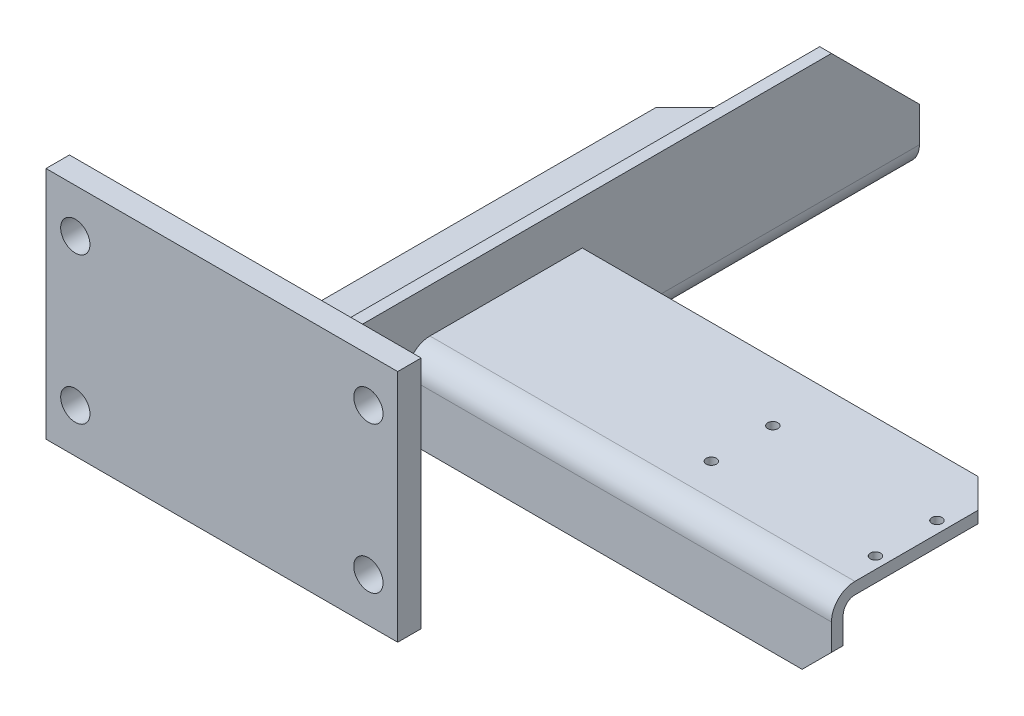
ISO-10303-21;
HEADER;
FILE_DESCRIPTION(('STEP AP214'),'2;1');
FILE_NAME('part.step','',(''),(''),'','','');
FILE_SCHEMA(('AUTOMOTIVE_DESIGN { 1 0 10303 214 1 1 1 1 }'));
ENDSEC;
DATA;
#1=APPLICATION_CONTEXT('core data for automotive mechanical design processes');
#2=APPLICATION_PROTOCOL_DEFINITION('international standard','automotive_design',2000,#1);
#3=PRODUCT_CONTEXT('',#1,'mechanical');
#4=PRODUCT('Part','Part','',(#3));
#5=PRODUCT_RELATED_PRODUCT_CATEGORY('part','',(#4));
#6=PRODUCT_DEFINITION_FORMATION('','',#4);
#7=PRODUCT_DEFINITION_CONTEXT('part definition',#1,'design');
#8=PRODUCT_DEFINITION('design','',#6,#7);
#9=PRODUCT_DEFINITION_SHAPE('','',#8);
#10=(LENGTH_UNIT() NAMED_UNIT(*) SI_UNIT(.MILLI.,.METRE.));
#11=(NAMED_UNIT(*) PLANE_ANGLE_UNIT() SI_UNIT($,.RADIAN.));
#12=(NAMED_UNIT(*) SI_UNIT($,.STERADIAN.) SOLID_ANGLE_UNIT());
#13=UNCERTAINTY_MEASURE_WITH_UNIT(LENGTH_MEASURE(1.E-05),#10,'distance_accuracy_value','');
#14=(GEOMETRIC_REPRESENTATION_CONTEXT(3) GLOBAL_UNCERTAINTY_ASSIGNED_CONTEXT((#13)) GLOBAL_UNIT_ASSIGNED_CONTEXT((#10,
#11,#12)) REPRESENTATION_CONTEXT('',''));
#15=CARTESIAN_POINT('',(0.,0.,0.));
#16=DIRECTION('',(0.,0.,1.));
#17=DIRECTION('',(1.,0.,0.));
#18=AXIS2_PLACEMENT_3D('',#15,#16,#17);
#19=CARTESIAN_POINT('',(90.,70.,-200.));
#20=DIRECTION('',(-1.,0.,0.));
#21=DIRECTION('',(0.,0.,1.));
#22=AXIS2_PLACEMENT_3D('',#19,#20,#21);
#23=PLANE('',#22);
#24=DIRECTION('',(0.,-1.,0.));
#25=VECTOR('',#24,1.);
#26=CARTESIAN_POINT('',(90.,47.,-25.));
#27=LINE('',#26,#25);
#28=CARTESIAN_POINT('',(90.,47.,-25.));
#29=VERTEX_POINT('',#28);
#30=CARTESIAN_POINT('',(90.,28.,-25.));
#31=VERTEX_POINT('',#30);
#32=EDGE_CURVE('E429',#29,#31,#27,.T.);
#33=ORIENTED_EDGE('',*,*,#32,.F.);
#34=CARTESIAN_POINT('',(90.,47.,-33.));
#35=DIRECTION('',(1.,0.,0.));
#36=DIRECTION('',(0.,0.,-1.));
#37=AXIS2_PLACEMENT_3D('',#34,#35,#36);
#38=CIRCLE('',#37,8.);
#39=CARTESIAN_POINT('',(90.,55.,-33.));
#40=VERTEX_POINT('',#39);
#41=EDGE_CURVE('E427',#40,#29,#38,.T.);
#42=ORIENTED_EDGE('',*,*,#41,.F.);
#43=DIRECTION('',(0.,0.,1.));
#44=VECTOR('',#43,1.);
#45=CARTESIAN_POINT('',(90.,55.,-85.));
#46=LINE('',#45,#44);
#47=CARTESIAN_POINT('',(90.,55.,-85.));
#48=VERTEX_POINT('',#47);
#49=EDGE_CURVE('E418',#48,#40,#46,.T.);
#50=ORIENTED_EDGE('',*,*,#49,.F.);
#51=DIRECTION('',(0.,1.,0.));
#52=VECTOR('',#51,1.);
#53=CARTESIAN_POINT('',(90.,51.,-85.));
#54=LINE('',#53,#52);
#55=CARTESIAN_POINT('',(90.,51.,-85.));
#56=VERTEX_POINT('',#55);
#57=EDGE_CURVE('E420',#56,#48,#54,.T.);
#58=ORIENTED_EDGE('',*,*,#57,.F.);
#59=DIRECTION('',(0.,0.,-1.));
#60=VECTOR('',#59,1.);
#61=CARTESIAN_POINT('',(90.,51.,-33.));
#62=LINE('',#61,#60);
#63=CARTESIAN_POINT('',(90.,51.,-33.));
#64=VERTEX_POINT('',#63);
#65=EDGE_CURVE('E423',#64,#56,#62,.T.);
#66=ORIENTED_EDGE('',*,*,#65,.F.);
#67=CARTESIAN_POINT('',(90.,47.,-33.));
#68=DIRECTION('',(-1.,0.,0.));
#69=DIRECTION('',(0.,0.,-1.));
#70=AXIS2_PLACEMENT_3D('',#67,#68,#69);
#71=CIRCLE('',#70,4.);
#72=CARTESIAN_POINT('',(90.,47.,-29.));
#73=VERTEX_POINT('',#72);
#74=EDGE_CURVE('E219',#73,#64,#71,.T.);
#75=ORIENTED_EDGE('',*,*,#74,.F.);
#76=DIRECTION('',(0.,1.,0.));
#77=VECTOR('',#76,1.);
#78=CARTESIAN_POINT('',(90.,28.,-29.));
#79=LINE('',#78,#77);
#80=CARTESIAN_POINT('',(90.,28.,-29.));
#81=VERTEX_POINT('',#80);
#82=EDGE_CURVE('E215',#81,#73,#79,.T.);
#83=ORIENTED_EDGE('',*,*,#82,.F.);
#84=DIRECTION('',(0.,0.,1.));
#85=VECTOR('',#84,1.);
#86=CARTESIAN_POINT('',(90.,28.,-200.));
#87=LINE('',#86,#85);
#88=CARTESIAN_POINT('',(90.,28.,-200.));
#89=VERTEX_POINT('',#88);
#90=EDGE_CURVE('E280',#89,#81,#87,.T.);
#91=ORIENTED_EDGE('',*,*,#90,.F.);
#92=DIRECTION('',(0.,-1.,0.));
#93=VECTOR('',#92,1.);
#94=CARTESIAN_POINT('',(90.,70.,-200.));
#95=LINE('',#94,#93);
#96=CARTESIAN_POINT('',(90.,40.,-200.));
#97=VERTEX_POINT('',#96);
#98=EDGE_CURVE('E248',#97,#89,#95,.T.);
#99=ORIENTED_EDGE('',*,*,#98,.F.);
#100=DIRECTION('',(0.,0.707106781186546,0.707106781186549));
#101=VECTOR('',#100,1.);
#102=CARTESIAN_POINT('',(90.,40.,-200.));
#103=LINE('',#102,#101);
#104=CARTESIAN_POINT('',(90.,70.,-170.));
#105=VERTEX_POINT('',#104);
#106=EDGE_CURVE('E355',#97,#105,#103,.T.);
#107=ORIENTED_EDGE('',*,*,#106,.T.);
#108=DIRECTION('',(0.,0.,1.));
#109=VECTOR('',#108,1.);
#110=CARTESIAN_POINT('',(90.,70.,-200.));
#111=LINE('',#110,#109);
#112=CARTESIAN_POINT('',(90.,70.,0.));
#113=VERTEX_POINT('',#112);
#114=EDGE_CURVE('E283',#105,#113,#111,.T.);
#115=ORIENTED_EDGE('',*,*,#114,.T.);
#116=DIRECTION('',(0.,-1.,0.));
#117=VECTOR('',#116,1.);
#118=CARTESIAN_POINT('',(90.,70.,0.));
#119=LINE('',#118,#117);
#120=CARTESIAN_POINT('',(90.,28.,0.));
#121=VERTEX_POINT('',#120);
#122=EDGE_CURVE('E268',#113,#121,#119,.T.);
#123=ORIENTED_EDGE('',*,*,#122,.T.);
#124=EDGE_CURVE('E279',#31,#121,#87,.T.);
#125=ORIENTED_EDGE('',*,*,#124,.F.);
#126=EDGE_LOOP('',(#33,#42,#50,#58,#66,#75,#83,#91,#99,#107,#115,#123,#125));
#127=FACE_BOUND('',#126,.T.);
#128=ADVANCED_FACE('F34',(#127),#23,.F.);
#129=CARTESIAN_POINT('',(0.,0.,0.));
#130=DIRECTION('',(0.,0.,-1.));
#131=DIRECTION('',(-1.,0.,0.));
#132=AXIS2_PLACEMENT_3D('',#129,#130,#131);
#133=PLANE('',#132);
#134=CARTESIAN_POINT('',(110.,65.,0.));
#135=DIRECTION('',(0.,0.,-1.));
#136=DIRECTION('',(-1.,0.,0.));
#137=AXIS2_PLACEMENT_3D('',#134,#135,#136);
#138=CIRCLE('',#137,5.00000000000001);
#139=CARTESIAN_POINT('',(105.,65.,0.));
#140=VERTEX_POINT('',#139);
#141=EDGE_CURVE('E295',#140,#140,#138,.F.);
#142=ORIENTED_EDGE('',*,*,#141,.T.);
#143=EDGE_LOOP('',(#142));
#144=FACE_BOUND('',#143,.T.);
#145=CARTESIAN_POINT('',(110.,15.,0.));
#146=DIRECTION('',(0.,0.,-1.));
#147=DIRECTION('',(-1.,0.,0.));
#148=AXIS2_PLACEMENT_3D('',#145,#146,#147);
#149=CIRCLE('',#148,5.);
#150=CARTESIAN_POINT('',(105.,15.,0.));
#151=VERTEX_POINT('',#150);
#152=EDGE_CURVE('E306',#151,#151,#149,.F.);
#153=ORIENTED_EDGE('',*,*,#152,.T.);
#154=EDGE_LOOP('',(#153));
#155=FACE_BOUND('',#154,.T.);
#156=CARTESIAN_POINT('',(10.,15.,0.));
#157=DIRECTION('',(0.,0.,-1.));
#158=DIRECTION('',(-1.,0.,0.));
#159=AXIS2_PLACEMENT_3D('',#156,#157,#158);
#160=CIRCLE('',#159,5.);
#161=CARTESIAN_POINT('',(5.,15.,0.));
#162=VERTEX_POINT('',#161);
#163=EDGE_CURVE('E300',#162,#162,#160,.F.);
#164=ORIENTED_EDGE('',*,*,#163,.T.);
#165=EDGE_LOOP('',(#164));
#166=FACE_BOUND('',#165,.T.);
#167=CARTESIAN_POINT('',(10.,65.,0.));
#168=DIRECTION('',(0.,0.,-1.));
#169=DIRECTION('',(-1.,0.,0.));
#170=AXIS2_PLACEMENT_3D('',#167,#168,#169);
#171=CIRCLE('',#170,5.);
#172=CARTESIAN_POINT('',(5.,65.,0.));
#173=VERTEX_POINT('',#172);
#174=EDGE_CURVE('E299',#173,#173,#171,.F.);
#175=ORIENTED_EDGE('',*,*,#174,.T.);
#176=EDGE_LOOP('',(#175));
#177=FACE_BOUND('',#176,.T.);
#178=DIRECTION('',(0.,-1.,0.));
#179=VECTOR('',#178,1.);
#180=CARTESIAN_POINT('',(0.,0.,0.));
#181=LINE('',#180,#179);
#182=CARTESIAN_POINT('',(0.,80.,0.));
#183=VERTEX_POINT('',#182);
#184=CARTESIAN_POINT('',(0.,0.,0.));
#185=VERTEX_POINT('',#184);
#186=EDGE_CURVE('E317',#183,#185,#181,.T.);
#187=ORIENTED_EDGE('',*,*,#186,.F.);
#188=DIRECTION('',(-1.,0.,0.));
#189=VECTOR('',#188,1.);
#190=CARTESIAN_POINT('',(0.,80.,0.));
#191=LINE('',#190,#189);
#192=CARTESIAN_POINT('',(120.,80.,0.));
#193=VERTEX_POINT('',#192);
#194=EDGE_CURVE('E324',#193,#183,#191,.T.);
#195=ORIENTED_EDGE('',*,*,#194,.F.);
#196=DIRECTION('',(0.,1.,0.));
#197=VECTOR('',#196,1.);
#198=CARTESIAN_POINT('',(120.,0.,0.));
#199=LINE('',#198,#197);
#200=CARTESIAN_POINT('',(120.,0.,0.));
#201=VERTEX_POINT('',#200);
#202=EDGE_CURVE('E335',#201,#193,#199,.T.);
#203=ORIENTED_EDGE('',*,*,#202,.F.);
#204=DIRECTION('',(1.,0.,0.));
#205=VECTOR('',#204,1.);
#206=CARTESIAN_POINT('',(0.,0.,0.));
#207=LINE('',#206,#205);
#208=EDGE_CURVE('E333',#185,#201,#207,.T.);
#209=ORIENTED_EDGE('',*,*,#208,.F.);
#210=EDGE_LOOP('',(#187,#195,#203,#209));
#211=FACE_BOUND('',#210,.T.);
#212=DIRECTION('',(1.,0.,0.));
#213=VECTOR('',#212,1.);
#214=CARTESIAN_POINT('',(82.,23.9667476786463,0.));
#215=LINE('',#214,#213);
#216=CARTESIAN_POINT('',(30.,23.9667476786462,0.));
#217=VERTEX_POINT('',#216);
#218=CARTESIAN_POINT('',(82.,23.9667476786462,0.));
#219=VERTEX_POINT('',#218);
#220=EDGE_CURVE('E258',#217,#219,#215,.T.);
#221=ORIENTED_EDGE('',*,*,#220,.F.);
#222=DIRECTION('',(0.,1.,0.));
#223=VECTOR('',#222,1.);
#224=CARTESIAN_POINT('',(30.,23.9667476786462,0.));
#225=LINE('',#224,#223);
#226=CARTESIAN_POINT('',(30.,20.,0.));
#227=VERTEX_POINT('',#226);
#228=EDGE_CURVE('E236',#227,#217,#225,.T.);
#229=ORIENTED_EDGE('',*,*,#228,.F.);
#230=DIRECTION('',(-1.,0.,0.));
#231=VECTOR('',#230,1.);
#232=CARTESIAN_POINT('',(30.,20.,0.));
#233=LINE('',#232,#231);
#234=CARTESIAN_POINT('',(82.,20.,0.));
#235=VERTEX_POINT('',#234);
#236=EDGE_CURVE('E243',#235,#227,#233,.T.);
#237=ORIENTED_EDGE('',*,*,#236,.F.);
#238=CARTESIAN_POINT('',(82.,28.,0.));
#239=DIRECTION('',(0.,0.,-1.));
#240=DIRECTION('',(-1.,0.,0.));
#241=AXIS2_PLACEMENT_3D('',#238,#239,#240);
#242=CIRCLE('',#241,8.);
#243=EDGE_CURVE('E271',#121,#235,#242,.T.);
#244=ORIENTED_EDGE('',*,*,#243,.F.);
#245=ORIENTED_EDGE('',*,*,#122,.F.);
#246=DIRECTION('',(1.,0.,0.));
#247=VECTOR('',#246,1.);
#248=CARTESIAN_POINT('',(86.,70.,0.));
#249=LINE('',#248,#247);
#250=CARTESIAN_POINT('',(86.,70.,0.));
#251=VERTEX_POINT('',#250);
#252=EDGE_CURVE('E265',#251,#113,#249,.T.);
#253=ORIENTED_EDGE('',*,*,#252,.F.);
#254=DIRECTION('',(0.,1.,0.));
#255=VECTOR('',#254,1.);
#256=CARTESIAN_POINT('',(86.,27.9667476786462,0.));
#257=LINE('',#256,#255);
#258=CARTESIAN_POINT('',(86.,27.9667476786462,0.));
#259=VERTEX_POINT('',#258);
#260=EDGE_CURVE('E262',#259,#251,#257,.T.);
#261=ORIENTED_EDGE('',*,*,#260,.F.);
#262=CARTESIAN_POINT('',(82.,27.9667476786462,0.));
#263=DIRECTION('',(0.,0.,1.));
#264=DIRECTION('',(-1.,0.,0.));
#265=AXIS2_PLACEMENT_3D('',#262,#263,#264);
#266=CIRCLE('',#265,4.00000000000001);
#267=EDGE_CURVE('E260',#219,#259,#266,.T.);
#268=ORIENTED_EDGE('',*,*,#267,.F.);
#269=EDGE_LOOP('',(#221,#229,#237,#244,#245,#253,#261,#268));
#270=FACE_BOUND('',#269,.T.);
#271=ADVANCED_FACE('F494',(#144,#155,#166,#177,#211,#270),#133,.T.);
#272=CARTESIAN_POINT('',(0.,0.,8.));
#273=DIRECTION('',(1.,0.,0.));
#274=DIRECTION('',(0.,0.,-1.));
#275=AXIS2_PLACEMENT_3D('',#272,#273,#274);
#276=PLANE('',#275);
#277=ORIENTED_EDGE('',*,*,#186,.T.);
#278=DIRECTION('',(0.,0.,-1.));
#279=VECTOR('',#278,1.);
#280=CARTESIAN_POINT('',(0.,0.,8.));
#281=LINE('',#280,#279);
#282=CARTESIAN_POINT('',(0.,0.,8.));
#283=VERTEX_POINT('',#282);
#284=EDGE_CURVE('E346',#283,#185,#281,.T.);
#285=ORIENTED_EDGE('',*,*,#284,.F.);
#286=DIRECTION('',(0.,-1.,0.));
#287=VECTOR('',#286,1.);
#288=CARTESIAN_POINT('',(0.,0.,8.));
#289=LINE('',#288,#287);
#290=CARTESIAN_POINT('',(0.,80.,8.));
#291=VERTEX_POINT('',#290);
#292=EDGE_CURVE('E320',#291,#283,#289,.T.);
#293=ORIENTED_EDGE('',*,*,#292,.F.);
#294=DIRECTION('',(0.,0.,-1.));
#295=VECTOR('',#294,1.);
#296=CARTESIAN_POINT('',(0.,80.,8.));
#297=LINE('',#296,#295);
#298=EDGE_CURVE('E330',#291,#183,#297,.T.);
#299=ORIENTED_EDGE('',*,*,#298,.T.);
#300=EDGE_LOOP('',(#277,#285,#293,#299));
#301=FACE_BOUND('',#300,.T.);
#302=ADVANCED_FACE('F499',(#301),#276,.F.);
#303=CARTESIAN_POINT('',(0.,0.,8.));
#304=DIRECTION('',(0.,1.,0.));
#305=DIRECTION('',(0.,0.,1.));
#306=AXIS2_PLACEMENT_3D('',#303,#304,#305);
#307=PLANE('',#306);
#308=ORIENTED_EDGE('',*,*,#208,.T.);
#309=DIRECTION('',(0.,0.,-1.));
#310=VECTOR('',#309,1.);
#311=CARTESIAN_POINT('',(120.,0.,8.));
#312=LINE('',#311,#310);
#313=CARTESIAN_POINT('',(120.,0.,8.));
#314=VERTEX_POINT('',#313);
#315=EDGE_CURVE('E343',#314,#201,#312,.T.);
#316=ORIENTED_EDGE('',*,*,#315,.F.);
#317=DIRECTION('',(1.,0.,0.));
#318=VECTOR('',#317,1.);
#319=CARTESIAN_POINT('',(0.,0.,8.));
#320=LINE('',#319,#318);
#321=EDGE_CURVE('E323',#283,#314,#320,.T.);
#322=ORIENTED_EDGE('',*,*,#321,.F.);
#323=ORIENTED_EDGE('',*,*,#284,.T.);
#324=EDGE_LOOP('',(#308,#316,#322,#323));
#325=FACE_BOUND('',#324,.T.);
#326=ADVANCED_FACE('F553',(#325),#307,.F.);
#327=CARTESIAN_POINT('',(120.,0.,8.));
#328=DIRECTION('',(-1.,0.,0.));
#329=DIRECTION('',(0.,0.,1.));
#330=AXIS2_PLACEMENT_3D('',#327,#328,#329);
#331=PLANE('',#330);
#332=ORIENTED_EDGE('',*,*,#202,.T.);
#333=DIRECTION('',(0.,0.,-1.));
#334=VECTOR('',#333,1.);
#335=CARTESIAN_POINT('',(120.,80.,8.));
#336=LINE('',#335,#334);
#337=CARTESIAN_POINT('',(120.,80.,8.));
#338=VERTEX_POINT('',#337);
#339=EDGE_CURVE('E340',#338,#193,#336,.T.);
#340=ORIENTED_EDGE('',*,*,#339,.F.);
#341=DIRECTION('',(0.,1.,0.));
#342=VECTOR('',#341,1.);
#343=CARTESIAN_POINT('',(120.,0.,8.));
#344=LINE('',#343,#342);
#345=EDGE_CURVE('E326',#314,#338,#344,.T.);
#346=ORIENTED_EDGE('',*,*,#345,.F.);
#347=ORIENTED_EDGE('',*,*,#315,.T.);
#348=EDGE_LOOP('',(#332,#340,#346,#347));
#349=FACE_BOUND('',#348,.T.);
#350=ADVANCED_FACE('F549',(#349),#331,.F.);
#351=CARTESIAN_POINT('',(0.,80.,8.));
#352=DIRECTION('',(0.,-1.,0.));
#353=DIRECTION('',(0.,0.,-1.));
#354=AXIS2_PLACEMENT_3D('',#351,#352,#353);
#355=PLANE('',#354);
#356=ORIENTED_EDGE('',*,*,#194,.T.);
#357=ORIENTED_EDGE('',*,*,#298,.F.);
#358=DIRECTION('',(-1.,0.,0.));
#359=VECTOR('',#358,1.);
#360=CARTESIAN_POINT('',(0.,80.,8.));
#361=LINE('',#360,#359);
#362=EDGE_CURVE('E328',#338,#291,#361,.T.);
#363=ORIENTED_EDGE('',*,*,#362,.F.);
#364=ORIENTED_EDGE('',*,*,#339,.T.);
#365=EDGE_LOOP('',(#356,#357,#363,#364));
#366=FACE_BOUND('',#365,.T.);
#367=ADVANCED_FACE('F544',(#366),#355,.F.);
#368=CARTESIAN_POINT('',(0.,0.,8.));
#369=DIRECTION('',(0.,0.,-1.));
#370=DIRECTION('',(-1.,0.,0.));
#371=AXIS2_PLACEMENT_3D('',#368,#369,#370);
#372=PLANE('',#371);
#373=CARTESIAN_POINT('',(110.,65.,8.));
#374=DIRECTION('',(0.,0.,1.));
#375=DIRECTION('',(1.,0.,0.));
#376=AXIS2_PLACEMENT_3D('',#373,#374,#375);
#377=CIRCLE('',#376,5.00000000000001);
#378=CARTESIAN_POINT('',(115.,65.,8.));
#379=VERTEX_POINT('',#378);
#380=EDGE_CURVE('E309',#379,#379,#377,.T.);
#381=ORIENTED_EDGE('',*,*,#380,.F.);
#382=EDGE_LOOP('',(#381));
#383=FACE_BOUND('',#382,.T.);
#384=CARTESIAN_POINT('',(110.,15.,8.));
#385=DIRECTION('',(0.,0.,1.));
#386=DIRECTION('',(1.,0.,0.));
#387=AXIS2_PLACEMENT_3D('',#384,#385,#386);
#388=CIRCLE('',#387,5.);
#389=CARTESIAN_POINT('',(115.,15.,8.));
#390=VERTEX_POINT('',#389);
#391=EDGE_CURVE('E303',#390,#390,#388,.T.);
#392=ORIENTED_EDGE('',*,*,#391,.F.);
#393=EDGE_LOOP('',(#392));
#394=FACE_BOUND('',#393,.T.);
#395=CARTESIAN_POINT('',(10.,15.,8.));
#396=DIRECTION('',(0.,0.,1.));
#397=DIRECTION('',(1.,0.,0.));
#398=AXIS2_PLACEMENT_3D('',#395,#396,#397);
#399=CIRCLE('',#398,5.);
#400=CARTESIAN_POINT('',(15.,15.,8.));
#401=VERTEX_POINT('',#400);
#402=EDGE_CURVE('E296',#401,#401,#399,.T.);
#403=ORIENTED_EDGE('',*,*,#402,.F.);
#404=EDGE_LOOP('',(#403));
#405=FACE_BOUND('',#404,.T.);
#406=CARTESIAN_POINT('',(10.,65.,8.));
#407=DIRECTION('',(0.,0.,1.));
#408=DIRECTION('',(1.,0.,0.));
#409=AXIS2_PLACEMENT_3D('',#406,#407,#408);
#410=CIRCLE('',#409,5.);
#411=CARTESIAN_POINT('',(15.,65.,8.));
#412=VERTEX_POINT('',#411);
#413=EDGE_CURVE('E314',#412,#412,#410,.T.);
#414=ORIENTED_EDGE('',*,*,#413,.F.);
#415=EDGE_LOOP('',(#414));
#416=FACE_BOUND('',#415,.T.);
#417=ORIENTED_EDGE('',*,*,#292,.T.);
#418=ORIENTED_EDGE('',*,*,#321,.T.);
#419=ORIENTED_EDGE('',*,*,#345,.T.);
#420=ORIENTED_EDGE('',*,*,#362,.T.);
#421=EDGE_LOOP('',(#417,#418,#419,#420));
#422=FACE_BOUND('',#421,.T.);
#423=ADVANCED_FACE('F541',(#383,#394,#405,#416,#422),#372,.F.);
#424=CARTESIAN_POINT('',(10.,65.,-0.000999999999999265));
#425=DIRECTION('',(0.,0.,1.));
#426=DIRECTION('',(1.,0.,0.));
#427=AXIS2_PLACEMENT_3D('',#424,#425,#426);
#428=CYLINDRICAL_SURFACE('',#427,5.);
#429=ORIENTED_EDGE('',*,*,#174,.F.);
#430=EDGE_LOOP('',(#429));
#431=FACE_BOUND('',#430,.T.);
#432=ORIENTED_EDGE('',*,*,#413,.T.);
#433=EDGE_LOOP('',(#432));
#434=FACE_BOUND('',#433,.T.);
#435=ADVANCED_FACE('F531',(#431,#434),#428,.F.);
#436=CARTESIAN_POINT('',(10.,15.,-0.000999999999999265));
#437=DIRECTION('',(0.,0.,1.));
#438=DIRECTION('',(1.,0.,0.));
#439=AXIS2_PLACEMENT_3D('',#436,#437,#438);
#440=CYLINDRICAL_SURFACE('',#439,5.);
#441=ORIENTED_EDGE('',*,*,#163,.F.);
#442=EDGE_LOOP('',(#441));
#443=FACE_BOUND('',#442,.T.);
#444=ORIENTED_EDGE('',*,*,#402,.T.);
#445=EDGE_LOOP('',(#444));
#446=FACE_BOUND('',#445,.T.);
#447=ADVANCED_FACE('F527',(#443,#446),#440,.F.);
#448=CARTESIAN_POINT('',(110.,15.,-0.000999999999999265));
#449=DIRECTION('',(0.,0.,1.));
#450=DIRECTION('',(1.,0.,0.));
#451=AXIS2_PLACEMENT_3D('',#448,#449,#450);
#452=CYLINDRICAL_SURFACE('',#451,5.);
#453=ORIENTED_EDGE('',*,*,#152,.F.);
#454=EDGE_LOOP('',(#453));
#455=FACE_BOUND('',#454,.T.);
#456=ORIENTED_EDGE('',*,*,#391,.T.);
#457=EDGE_LOOP('',(#456));
#458=FACE_BOUND('',#457,.T.);
#459=ADVANCED_FACE('F530',(#455,#458),#452,.F.);
#460=CARTESIAN_POINT('',(110.,65.,-0.000999999999999265));
#461=DIRECTION('',(0.,0.,1.));
#462=DIRECTION('',(1.,0.,0.));
#463=AXIS2_PLACEMENT_3D('',#460,#461,#462);
#464=CYLINDRICAL_SURFACE('',#463,5.00000000000001);
#465=ORIENTED_EDGE('',*,*,#141,.F.);
#466=EDGE_LOOP('',(#465));
#467=FACE_BOUND('',#466,.T.);
#468=ORIENTED_EDGE('',*,*,#380,.T.);
#469=EDGE_LOOP('',(#468));
#470=FACE_BOUND('',#469,.T.);
#471=ADVANCED_FACE('F525',(#467,#470),#464,.F.);
#472=CARTESIAN_POINT('',(30.,23.9667476786462,-200.));
#473=DIRECTION('',(1.,0.,0.));
#474=DIRECTION('',(0.,0.,-1.));
#475=AXIS2_PLACEMENT_3D('',#472,#473,#474);
#476=PLANE('',#475);
#477=DIRECTION('',(0.,0.,1.));
#478=VECTOR('',#477,1.);
#479=CARTESIAN_POINT('',(30.,23.9667476786462,-200.));
#480=LINE('',#479,#478);
#481=CARTESIAN_POINT('',(30.,23.9667476786462,-170.));
#482=VERTEX_POINT('',#481);
#483=EDGE_CURVE('E293',#482,#217,#480,.T.);
#484=ORIENTED_EDGE('',*,*,#483,.F.);
#485=DIRECTION('',(0.,-1.,0.));
#486=VECTOR('',#485,1.);
#487=CARTESIAN_POINT('',(30.,20.,-170.));
#488=LINE('',#487,#486);
#489=CARTESIAN_POINT('',(30.,20.,-170.));
#490=VERTEX_POINT('',#489);
#491=EDGE_CURVE('E363',#482,#490,#488,.T.);
#492=ORIENTED_EDGE('',*,*,#491,.T.);
#493=DIRECTION('',(0.,0.,1.));
#494=VECTOR('',#493,1.);
#495=CARTESIAN_POINT('',(30.,20.,-200.));
#496=LINE('',#495,#494);
#497=EDGE_CURVE('E255',#490,#227,#496,.T.);
#498=ORIENTED_EDGE('',*,*,#497,.T.);
#499=ORIENTED_EDGE('',*,*,#228,.T.);
#500=EDGE_LOOP('',(#484,#492,#498,#499));
#501=FACE_BOUND('',#500,.T.);
#502=ADVANCED_FACE('F521',(#501),#476,.F.);
#503=CARTESIAN_POINT('',(82.,23.9667476786463,-200.));
#504=DIRECTION('',(0.,-1.,0.));
#505=DIRECTION('',(1.,0.,0.));
#506=AXIS2_PLACEMENT_3D('',#503,#504,#505);
#507=PLANE('',#506);
#508=CARTESIAN_POINT('',(60.,23.9667476786462,-70.));
#509=DIRECTION('',(0.,-1.,0.));
#510=DIRECTION('',(1.,0.,0.));
#511=AXIS2_PLACEMENT_3D('',#508,#509,#510);
#512=CIRCLE('',#511,5.);
#513=CARTESIAN_POINT('',(65.,23.9667476786462,-70.));
#514=VERTEX_POINT('',#513);
#515=EDGE_CURVE('E234',#514,#514,#512,.F.);
#516=ORIENTED_EDGE('',*,*,#515,.F.);
#517=EDGE_LOOP('',(#516));
#518=FACE_BOUND('',#517,.T.);
#519=CARTESIAN_POINT('',(60.,23.9667476786462,-120.));
#520=DIRECTION('',(0.,-1.,0.));
#521=DIRECTION('',(1.,0.,0.));
#522=AXIS2_PLACEMENT_3D('',#519,#520,#521);
#523=CIRCLE('',#522,5.00000000000001);
#524=CARTESIAN_POINT('',(65.,23.9667476786462,-120.));
#525=VERTEX_POINT('',#524);
#526=EDGE_CURVE('E225',#525,#525,#523,.F.);
#527=ORIENTED_EDGE('',*,*,#526,.F.);
#528=EDGE_LOOP('',(#527));
#529=FACE_BOUND('',#528,.T.);
#530=DIRECTION('',(1.,0.,0.));
#531=VECTOR('',#530,1.);
#532=CARTESIAN_POINT('',(82.,23.9667476786463,-200.));
#533=LINE('',#532,#531);
#534=CARTESIAN_POINT('',(59.9999999999999,23.9667476786463,-200.));
#535=VERTEX_POINT('',#534);
#536=CARTESIAN_POINT('',(82.,23.9667476786462,-200.));
#537=VERTEX_POINT('',#536);
#538=EDGE_CURVE('E240',#535,#537,#533,.T.);
#539=ORIENTED_EDGE('',*,*,#538,.F.);
#540=DIRECTION('',(-0.707106781186546,0.,0.707106781186549));
#541=VECTOR('',#540,1.);
#542=CARTESIAN_POINT('',(59.9999999999999,23.9667476786462,-200.));
#543=LINE('',#542,#541);
#544=EDGE_CURVE('E361',#535,#482,#543,.T.);
#545=ORIENTED_EDGE('',*,*,#544,.T.);
#546=ORIENTED_EDGE('',*,*,#483,.T.);
#547=ORIENTED_EDGE('',*,*,#220,.T.);
#548=DIRECTION('',(0.,0.,1.));
#549=VECTOR('',#548,1.);
#550=CARTESIAN_POINT('',(82.,23.9667476786462,-200.));
#551=LINE('',#550,#549);
#552=EDGE_CURVE('E290',#537,#219,#551,.T.);
#553=ORIENTED_EDGE('',*,*,#552,.F.);
#554=EDGE_LOOP('',(#539,#545,#546,#547,#553));
#555=FACE_BOUND('',#554,.T.);
#556=ADVANCED_FACE('F517',(#518,#529,#555),#507,.F.);
#557=CARTESIAN_POINT('',(82.,27.9667476786462,-200.));
#558=DIRECTION('',(0.,0.,1.));
#559=DIRECTION('',(1.,0.,0.));
#560=AXIS2_PLACEMENT_3D('',#557,#558,#559);
#561=CYLINDRICAL_SURFACE('',#560,4.00000000000001);
#562=ORIENTED_EDGE('',*,*,#267,.T.);
#563=DIRECTION('',(0.,0.,1.));
#564=VECTOR('',#563,1.);
#565=CARTESIAN_POINT('',(86.,27.9667476786462,-200.));
#566=LINE('',#565,#564);
#567=CARTESIAN_POINT('',(86.,27.9667476786462,-200.));
#568=VERTEX_POINT('',#567);
#569=EDGE_CURVE('E287',#568,#259,#566,.T.);
#570=ORIENTED_EDGE('',*,*,#569,.F.);
#571=CARTESIAN_POINT('',(82.,27.9667476786462,-200.));
#572=DIRECTION('',(0.,0.,1.));
#573=DIRECTION('',(-1.,0.,0.));
#574=AXIS2_PLACEMENT_3D('',#571,#572,#573);
#575=CIRCLE('',#574,4.00000000000001);
#576=EDGE_CURVE('E242',#537,#568,#575,.T.);
#577=ORIENTED_EDGE('',*,*,#576,.F.);
#578=ORIENTED_EDGE('',*,*,#552,.T.);
#579=EDGE_LOOP('',(#562,#570,#577,#578));
#580=FACE_BOUND('',#579,.T.);
#581=ADVANCED_FACE('F513',(#580),#561,.F.);
#582=CARTESIAN_POINT('',(86.,27.9667476786462,-200.));
#583=DIRECTION('',(1.,0.,0.));
#584=DIRECTION('',(0.,1.,0.));
#585=AXIS2_PLACEMENT_3D('',#582,#583,#584);
#586=PLANE('',#585);
#587=DIRECTION('',(0.,0.,1.));
#588=VECTOR('',#587,1.);
#589=CARTESIAN_POINT('',(86.,70.,-200.));
#590=LINE('',#589,#588);
#591=CARTESIAN_POINT('',(86.,70.,-170.));
#592=VERTEX_POINT('',#591);
#593=EDGE_CURVE('E285',#592,#251,#590,.T.);
#594=ORIENTED_EDGE('',*,*,#593,.F.);
#595=DIRECTION('',(0.,-0.707106781186546,-0.707106781186549));
#596=VECTOR('',#595,1.);
#597=CARTESIAN_POINT('',(86.,40.,-200.));
#598=LINE('',#597,#596);
#599=CARTESIAN_POINT('',(86.,40.,-200.));
#600=VERTEX_POINT('',#599);
#601=EDGE_CURVE('E359',#592,#600,#598,.T.);
#602=ORIENTED_EDGE('',*,*,#601,.T.);
#603=DIRECTION('',(0.,1.,0.));
#604=VECTOR('',#603,1.);
#605=CARTESIAN_POINT('',(86.,27.9667476786462,-200.));
#606=LINE('',#605,#604);
#607=EDGE_CURVE('E245',#568,#600,#606,.T.);
#608=ORIENTED_EDGE('',*,*,#607,.F.);
#609=ORIENTED_EDGE('',*,*,#569,.T.);
#610=ORIENTED_EDGE('',*,*,#260,.T.);
#611=EDGE_LOOP('',(#594,#602,#608,#609,#610));
#612=FACE_BOUND('',#611,.T.);
#613=ADVANCED_FACE('F509',(#612),#586,.F.);
#614=CARTESIAN_POINT('',(86.,70.,-200.));
#615=DIRECTION('',(0.,-1.,0.));
#616=DIRECTION('',(0.,0.,-1.));
#617=AXIS2_PLACEMENT_3D('',#614,#615,#616);
#618=PLANE('',#617);
#619=ORIENTED_EDGE('',*,*,#114,.F.);
#620=DIRECTION('',(-1.,0.,0.));
#621=VECTOR('',#620,1.);
#622=CARTESIAN_POINT('',(86.,70.,-170.));
#623=LINE('',#622,#621);
#624=EDGE_CURVE('E357',#105,#592,#623,.T.);
#625=ORIENTED_EDGE('',*,*,#624,.T.);
#626=ORIENTED_EDGE('',*,*,#593,.T.);
#627=ORIENTED_EDGE('',*,*,#252,.T.);
#628=EDGE_LOOP('',(#619,#625,#626,#627));
#629=FACE_BOUND('',#628,.T.);
#630=ADVANCED_FACE('F506',(#629),#618,.F.);
#631=CARTESIAN_POINT('',(82.,28.,-200.));
#632=DIRECTION('',(0.,0.,1.));
#633=DIRECTION('',(1.,0.,0.));
#634=AXIS2_PLACEMENT_3D('',#631,#632,#633);
#635=CYLINDRICAL_SURFACE('',#634,8.);
#636=ORIENTED_EDGE('',*,*,#243,.T.);
#637=DIRECTION('',(0.,0.,1.));
#638=VECTOR('',#637,1.);
#639=CARTESIAN_POINT('',(82.,20.,-200.));
#640=LINE('',#639,#638);
#641=CARTESIAN_POINT('',(82.,20.,-200.));
#642=VERTEX_POINT('',#641);
#643=EDGE_CURVE('E277',#642,#235,#640,.T.);
#644=ORIENTED_EDGE('',*,*,#643,.F.);
#645=CARTESIAN_POINT('',(82.,28.,-200.));
#646=DIRECTION('',(0.,0.,-1.));
#647=DIRECTION('',(-1.,0.,0.));
#648=AXIS2_PLACEMENT_3D('',#645,#646,#647);
#649=CIRCLE('',#648,8.);
#650=EDGE_CURVE('E250',#89,#642,#649,.T.);
#651=ORIENTED_EDGE('',*,*,#650,.F.);
#652=ORIENTED_EDGE('',*,*,#90,.T.);
#653=DIRECTION('',(0.,0.,-1.));
#654=VECTOR('',#653,1.);
#655=CARTESIAN_POINT('',(90.,28.,-25.));
#656=LINE('',#655,#654);
#657=EDGE_CURVE('E402',#31,#81,#656,.T.);
#658=ORIENTED_EDGE('',*,*,#657,.F.);
#659=ORIENTED_EDGE('',*,*,#124,.T.);
#660=EDGE_LOOP('',(#636,#644,#651,#652,#658,#659));
#661=FACE_BOUND('',#660,.T.);
#662=ADVANCED_FACE('F504',(#661),#635,.T.);
#663=CARTESIAN_POINT('',(30.,20.,-200.));
#664=DIRECTION('',(0.,1.,0.));
#665=DIRECTION('',(-1.,0.,0.));
#666=AXIS2_PLACEMENT_3D('',#663,#664,#665);
#667=PLANE('',#666);
#668=CARTESIAN_POINT('',(60.,20.,-70.));
#669=DIRECTION('',(0.,-1.,0.));
#670=DIRECTION('',(1.,0.,0.));
#671=AXIS2_PLACEMENT_3D('',#668,#669,#670);
#672=CIRCLE('',#671,5.);
#673=CARTESIAN_POINT('',(65.,20.,-70.));
#674=VERTEX_POINT('',#673);
#675=EDGE_CURVE('E231',#674,#674,#672,.T.);
#676=ORIENTED_EDGE('',*,*,#675,.F.);
#677=EDGE_LOOP('',(#676));
#678=FACE_BOUND('',#677,.T.);
#679=CARTESIAN_POINT('',(60.,20.,-120.));
#680=DIRECTION('',(0.,-1.,0.));
#681=DIRECTION('',(1.,0.,0.));
#682=AXIS2_PLACEMENT_3D('',#679,#680,#681);
#683=CIRCLE('',#682,5.00000000000001);
#684=CARTESIAN_POINT('',(65.,20.,-120.));
#685=VERTEX_POINT('',#684);
#686=EDGE_CURVE('E221',#685,#685,#683,.T.);
#687=ORIENTED_EDGE('',*,*,#686,.F.);
#688=EDGE_LOOP('',(#687));
#689=FACE_BOUND('',#688,.T.);
#690=ORIENTED_EDGE('',*,*,#497,.F.);
#691=DIRECTION('',(0.707106781186546,0.,-0.707106781186549));
#692=VECTOR('',#691,1.);
#693=CARTESIAN_POINT('',(59.9999999999999,20.,-200.));
#694=LINE('',#693,#692);
#695=CARTESIAN_POINT('',(59.9999999999999,20.,-200.));
#696=VERTEX_POINT('',#695);
#697=EDGE_CURVE('E365',#490,#696,#694,.T.);
#698=ORIENTED_EDGE('',*,*,#697,.T.);
#699=DIRECTION('',(-1.,0.,0.));
#700=VECTOR('',#699,1.);
#701=CARTESIAN_POINT('',(30.,20.,-200.));
#702=LINE('',#701,#700);
#703=EDGE_CURVE('E252',#642,#696,#702,.T.);
#704=ORIENTED_EDGE('',*,*,#703,.F.);
#705=ORIENTED_EDGE('',*,*,#643,.T.);
#706=ORIENTED_EDGE('',*,*,#236,.T.);
#707=EDGE_LOOP('',(#690,#698,#704,#705,#706));
#708=FACE_BOUND('',#707,.T.);
#709=ADVANCED_FACE('F616',(#678,#689,#708),#667,.F.);
#710=CARTESIAN_POINT('',(82.,28.,-200.));
#711=DIRECTION('',(0.,0.,-1.));
#712=DIRECTION('',(-1.,0.,0.));
#713=AXIS2_PLACEMENT_3D('',#710,#711,#712);
#714=PLANE('',#713);
#715=ORIENTED_EDGE('',*,*,#607,.T.);
#716=DIRECTION('',(1.,0.,0.));
#717=VECTOR('',#716,1.);
#718=CARTESIAN_POINT('',(90.,40.,-200.));
#719=LINE('',#718,#717);
#720=EDGE_CURVE('E352',#600,#97,#719,.T.);
#721=ORIENTED_EDGE('',*,*,#720,.T.);
#722=ORIENTED_EDGE('',*,*,#98,.T.);
#723=ORIENTED_EDGE('',*,*,#650,.T.);
#724=ORIENTED_EDGE('',*,*,#703,.T.);
#725=DIRECTION('',(0.,1.,0.));
#726=VECTOR('',#725,1.);
#727=CARTESIAN_POINT('',(59.9999999999999,23.9667476786462,-200.));
#728=LINE('',#727,#726);
#729=EDGE_CURVE('E349',#696,#535,#728,.T.);
#730=ORIENTED_EDGE('',*,*,#729,.T.);
#731=ORIENTED_EDGE('',*,*,#538,.T.);
#732=ORIENTED_EDGE('',*,*,#576,.T.);
#733=EDGE_LOOP('',(#715,#721,#722,#723,#724,#730,#731,#732));
#734=FACE_BOUND('',#733,.T.);
#735=ADVANCED_FACE('F565',(#734),#714,.T.);
#736=CARTESIAN_POINT('',(82.,40.,-200.));
#737=DIRECTION('',(0.,0.707106781186549,-0.707106781186546));
#738=DIRECTION('',(-1.,0.,0.));
#739=AXIS2_PLACEMENT_3D('',#736,#737,#738);
#740=PLANE('',#739);
#741=ORIENTED_EDGE('',*,*,#601,.F.);
#742=ORIENTED_EDGE('',*,*,#624,.F.);
#743=ORIENTED_EDGE('',*,*,#106,.F.);
#744=ORIENTED_EDGE('',*,*,#720,.F.);
#745=EDGE_LOOP('',(#741,#742,#743,#744));
#746=FACE_BOUND('',#745,.T.);
#747=ADVANCED_FACE('F561',(#746),#740,.T.);
#748=CARTESIAN_POINT('',(59.9999999999999,28.,-200.));
#749=DIRECTION('',(-0.707106781186549,0.,-0.707106781186546));
#750=DIRECTION('',(0.,-1.,0.));
#751=AXIS2_PLACEMENT_3D('',#748,#749,#750);
#752=PLANE('',#751);
#753=ORIENTED_EDGE('',*,*,#697,.F.);
#754=ORIENTED_EDGE('',*,*,#491,.F.);
#755=ORIENTED_EDGE('',*,*,#544,.F.);
#756=ORIENTED_EDGE('',*,*,#729,.F.);
#757=EDGE_LOOP('',(#753,#754,#755,#756));
#758=FACE_BOUND('',#757,.T.);
#759=ADVANCED_FACE('F564',(#758),#752,.T.);
#760=CARTESIAN_POINT('',(60.,80.001,-120.));
#761=DIRECTION('',(0.,-1.,0.));
#762=DIRECTION('',(1.,0.,0.));
#763=AXIS2_PLACEMENT_3D('',#760,#761,#762);
#764=CYLINDRICAL_SURFACE('',#763,5.00000000000001);
#765=ORIENTED_EDGE('',*,*,#686,.T.);
#766=EDGE_LOOP('',(#765));
#767=FACE_BOUND('',#766,.T.);
#768=ORIENTED_EDGE('',*,*,#526,.T.);
#769=EDGE_LOOP('',(#768));
#770=FACE_BOUND('',#769,.T.);
#771=ADVANCED_FACE('F568',(#767,#770),#764,.F.);
#772=CARTESIAN_POINT('',(60.,80.001,-70.));
#773=DIRECTION('',(0.,-1.,0.));
#774=DIRECTION('',(1.,0.,0.));
#775=AXIS2_PLACEMENT_3D('',#772,#773,#774);
#776=CYLINDRICAL_SURFACE('',#775,5.);
#777=ORIENTED_EDGE('',*,*,#675,.T.);
#778=EDGE_LOOP('',(#777));
#779=FACE_BOUND('',#778,.T.);
#780=ORIENTED_EDGE('',*,*,#515,.T.);
#781=EDGE_LOOP('',(#780));
#782=FACE_BOUND('',#781,.T.);
#783=ADVANCED_FACE('F489',(#779,#782),#776,.F.);
#784=CARTESIAN_POINT('',(235.,47.,-33.));
#785=DIRECTION('',(-1.,0.,0.));
#786=DIRECTION('',(0.,0.,1.));
#787=AXIS2_PLACEMENT_3D('',#784,#785,#786);
#788=CYLINDRICAL_SURFACE('',#787,4.);
#789=ORIENTED_EDGE('',*,*,#74,.T.);
#790=DIRECTION('',(-1.,0.,0.));
#791=VECTOR('',#790,1.);
#792=CARTESIAN_POINT('',(235.,51.,-33.));
#793=LINE('',#792,#791);
#794=CARTESIAN_POINT('',(235.,51.,-33.));
#795=VERTEX_POINT('',#794);
#796=EDGE_CURVE('E197',#795,#64,#793,.T.);
#797=ORIENTED_EDGE('',*,*,#796,.F.);
#798=CARTESIAN_POINT('',(235.,47.,-33.));
#799=DIRECTION('',(-1.,0.,0.));
#800=DIRECTION('',(0.,0.,-1.));
#801=AXIS2_PLACEMENT_3D('',#798,#799,#800);
#802=CIRCLE('',#801,4.);
#803=CARTESIAN_POINT('',(235.,47.,-29.));
#804=VERTEX_POINT('',#803);
#805=EDGE_CURVE('E204',#804,#795,#802,.T.);
#806=ORIENTED_EDGE('',*,*,#805,.F.);
#807=DIRECTION('',(-1.,0.,0.));
#808=VECTOR('',#807,1.);
#809=CARTESIAN_POINT('',(235.,47.,-29.));
#810=LINE('',#809,#808);
#811=EDGE_CURVE('E404',#804,#73,#810,.T.);
#812=ORIENTED_EDGE('',*,*,#811,.T.);
#813=EDGE_LOOP('',(#789,#797,#806,#812));
#814=FACE_BOUND('',#813,.T.);
#815=ADVANCED_FACE('F217',(#814),#788,.F.);
#816=CARTESIAN_POINT('',(235.,51.,-33.));
#817=DIRECTION('',(0.,1.,0.));
#818=DIRECTION('',(0.,0.,1.));
#819=AXIS2_PLACEMENT_3D('',#816,#817,#818);
#820=PLANE('',#819);
#821=CARTESIAN_POINT('',(175.,51.,-65.));
#822=DIRECTION('',(0.,1.,0.));
#823=DIRECTION('',(0.,0.,1.));
#824=AXIS2_PLACEMENT_3D('',#821,#822,#823);
#825=CIRCLE('',#824,1.75000000000001);
#826=CARTESIAN_POINT('',(175.,51.,-63.25));
#827=VERTEX_POINT('',#826);
#828=EDGE_CURVE('E447',#827,#827,#825,.F.);
#829=ORIENTED_EDGE('',*,*,#828,.F.);
#830=EDGE_LOOP('',(#829));
#831=FACE_BOUND('',#830,.T.);
#832=CARTESIAN_POINT('',(175.,51.,-44.));
#833=DIRECTION('',(0.,1.,0.));
#834=DIRECTION('',(0.,0.,1.));
#835=AXIS2_PLACEMENT_3D('',#832,#833,#834);
#836=CIRCLE('',#835,1.75000000000001);
#837=CARTESIAN_POINT('',(175.,51.,-42.25));
#838=VERTEX_POINT('',#837);
#839=EDGE_CURVE('E454',#838,#838,#836,.F.);
#840=ORIENTED_EDGE('',*,*,#839,.F.);
#841=EDGE_LOOP('',(#840));
#842=FACE_BOUND('',#841,.T.);
#843=CARTESIAN_POINT('',(231.,51.,-44.));
#844=DIRECTION('',(0.,1.,0.));
#845=DIRECTION('',(0.,0.,1.));
#846=AXIS2_PLACEMENT_3D('',#843,#844,#845);
#847=CIRCLE('',#846,1.75000000000001);
#848=CARTESIAN_POINT('',(231.,51.,-42.25));
#849=VERTEX_POINT('',#848);
#850=EDGE_CURVE('E446',#849,#849,#847,.F.);
#851=ORIENTED_EDGE('',*,*,#850,.F.);
#852=EDGE_LOOP('',(#851));
#853=FACE_BOUND('',#852,.T.);
#854=CARTESIAN_POINT('',(231.,51.,-65.));
#855=DIRECTION('',(0.,1.,0.));
#856=DIRECTION('',(0.,0.,1.));
#857=AXIS2_PLACEMENT_3D('',#854,#855,#856);
#858=CIRCLE('',#857,1.75000000000001);
#859=CARTESIAN_POINT('',(231.,51.,-63.25));
#860=VERTEX_POINT('',#859);
#861=EDGE_CURVE('E435',#860,#860,#858,.F.);
#862=ORIENTED_EDGE('',*,*,#861,.F.);
#863=EDGE_LOOP('',(#862));
#864=FACE_BOUND('',#863,.T.);
#865=DIRECTION('',(-1.,0.,0.));
#866=VECTOR('',#865,1.);
#867=CARTESIAN_POINT('',(235.,51.,-85.));
#868=LINE('',#867,#866);
#869=CARTESIAN_POINT('',(225.,51.,-85.));
#870=VERTEX_POINT('',#869);
#871=EDGE_CURVE('E222',#870,#56,#868,.T.);
#872=ORIENTED_EDGE('',*,*,#871,.F.);
#873=DIRECTION('',(0.70710678118655,0.,0.707106781186545));
#874=VECTOR('',#873,1.);
#875=CARTESIAN_POINT('',(235.,51.,-75.));
#876=LINE('',#875,#874);
#877=CARTESIAN_POINT('',(235.,51.,-75.));
#878=VERTEX_POINT('',#877);
#879=EDGE_CURVE('E11',#870,#878,#876,.T.);
#880=ORIENTED_EDGE('',*,*,#879,.T.);
#881=DIRECTION('',(0.,0.,-1.));
#882=VECTOR('',#881,1.);
#883=CARTESIAN_POINT('',(235.,51.,-33.));
#884=LINE('',#883,#882);
#885=EDGE_CURVE('E192',#795,#878,#884,.T.);
#886=ORIENTED_EDGE('',*,*,#885,.F.);
#887=ORIENTED_EDGE('',*,*,#796,.T.);
#888=ORIENTED_EDGE('',*,*,#65,.T.);
#889=EDGE_LOOP('',(#872,#880,#886,#887,#888));
#890=FACE_BOUND('',#889,.T.);
#891=ADVANCED_FACE('F194',(#831,#842,#853,#864,#890),#820,.F.);
#892=CARTESIAN_POINT('',(235.,51.,-85.));
#893=DIRECTION('',(0.,0.,1.));
#894=DIRECTION('',(1.,0.,0.));
#895=AXIS2_PLACEMENT_3D('',#892,#893,#894);
#896=PLANE('',#895);
#897=DIRECTION('',(-1.,0.,0.));
#898=VECTOR('',#897,1.);
#899=CARTESIAN_POINT('',(235.,55.,-85.));
#900=LINE('',#899,#898);
#901=CARTESIAN_POINT('',(225.,55.,-85.));
#902=VERTEX_POINT('',#901);
#903=EDGE_CURVE('E227',#902,#48,#900,.T.);
#904=ORIENTED_EDGE('',*,*,#903,.F.);
#905=DIRECTION('',(0.,-1.,0.));
#906=VECTOR('',#905,1.);
#907=CARTESIAN_POINT('',(225.,51.,-85.));
#908=LINE('',#907,#906);
#909=EDGE_CURVE('E42',#902,#870,#908,.T.);
#910=ORIENTED_EDGE('',*,*,#909,.T.);
#911=ORIENTED_EDGE('',*,*,#871,.T.);
#912=ORIENTED_EDGE('',*,*,#57,.T.);
#913=EDGE_LOOP('',(#904,#910,#911,#912));
#914=FACE_BOUND('',#913,.T.);
#915=ADVANCED_FACE('F421',(#914),#896,.F.);
#916=CARTESIAN_POINT('',(235.,55.,-85.));
#917=DIRECTION('',(0.,-1.,0.));
#918=DIRECTION('',(0.,0.,-1.));
#919=AXIS2_PLACEMENT_3D('',#916,#917,#918);
#920=PLANE('',#919);
#921=CARTESIAN_POINT('',(175.,55.,-65.));
#922=DIRECTION('',(0.,1.,0.));
#923=DIRECTION('',(0.,0.,1.));
#924=AXIS2_PLACEMENT_3D('',#921,#922,#923);
#925=CIRCLE('',#924,1.75000000000001);
#926=CARTESIAN_POINT('',(175.,55.,-63.25));
#927=VERTEX_POINT('',#926);
#928=EDGE_CURVE('E451',#927,#927,#925,.T.);
#929=ORIENTED_EDGE('',*,*,#928,.F.);
#930=EDGE_LOOP('',(#929));
#931=FACE_BOUND('',#930,.T.);
#932=CARTESIAN_POINT('',(175.,55.,-44.));
#933=DIRECTION('',(0.,1.,0.));
#934=DIRECTION('',(0.,0.,1.));
#935=AXIS2_PLACEMENT_3D('',#932,#933,#934);
#936=CIRCLE('',#935,1.75000000000001);
#937=CARTESIAN_POINT('',(175.,55.,-42.25));
#938=VERTEX_POINT('',#937);
#939=EDGE_CURVE('E450',#938,#938,#936,.T.);
#940=ORIENTED_EDGE('',*,*,#939,.F.);
#941=EDGE_LOOP('',(#940));
#942=FACE_BOUND('',#941,.T.);
#943=CARTESIAN_POINT('',(231.,55.,-44.));
#944=DIRECTION('',(0.,1.,0.));
#945=DIRECTION('',(0.,0.,1.));
#946=AXIS2_PLACEMENT_3D('',#943,#944,#945);
#947=CIRCLE('',#946,1.75000000000001);
#948=CARTESIAN_POINT('',(231.,55.,-42.25));
#949=VERTEX_POINT('',#948);
#950=EDGE_CURVE('E457',#949,#949,#947,.T.);
#951=ORIENTED_EDGE('',*,*,#950,.F.);
#952=EDGE_LOOP('',(#951));
#953=FACE_BOUND('',#952,.T.);
#954=CARTESIAN_POINT('',(231.,55.,-65.));
#955=DIRECTION('',(0.,1.,0.));
#956=DIRECTION('',(0.,0.,1.));
#957=AXIS2_PLACEMENT_3D('',#954,#955,#956);
#958=CIRCLE('',#957,1.75000000000001);
#959=CARTESIAN_POINT('',(231.,55.,-63.25));
#960=VERTEX_POINT('',#959);
#961=EDGE_CURVE('E438',#960,#960,#958,.T.);
#962=ORIENTED_EDGE('',*,*,#961,.F.);
#963=EDGE_LOOP('',(#962));
#964=FACE_BOUND('',#963,.T.);
#965=DIRECTION('',(0.,0.,1.));
#966=VECTOR('',#965,1.);
#967=CARTESIAN_POINT('',(235.,55.,-85.));
#968=LINE('',#967,#966);
#969=CARTESIAN_POINT('',(235.,55.,-75.));
#970=VERTEX_POINT('',#969);
#971=CARTESIAN_POINT('',(235.,55.,-33.));
#972=VERTEX_POINT('',#971);
#973=EDGE_CURVE('E203',#970,#972,#968,.T.);
#974=ORIENTED_EDGE('',*,*,#973,.F.);
#975=DIRECTION('',(-0.70710678118655,0.,-0.707106781186545));
#976=VECTOR('',#975,1.);
#977=CARTESIAN_POINT('',(235.,55.,-75.));
#978=LINE('',#977,#976);
#979=EDGE_CURVE('E56',#970,#902,#978,.T.);
#980=ORIENTED_EDGE('',*,*,#979,.T.);
#981=ORIENTED_EDGE('',*,*,#903,.T.);
#982=ORIENTED_EDGE('',*,*,#49,.T.);
#983=DIRECTION('',(-1.,0.,0.));
#984=VECTOR('',#983,1.);
#985=CARTESIAN_POINT('',(235.,55.,-33.));
#986=LINE('',#985,#984);
#987=EDGE_CURVE('E412',#972,#40,#986,.T.);
#988=ORIENTED_EDGE('',*,*,#987,.F.);
#989=EDGE_LOOP('',(#974,#980,#981,#982,#988));
#990=FACE_BOUND('',#989,.T.);
#991=ADVANCED_FACE('F415',(#931,#942,#953,#964,#990),#920,.F.);
#992=CARTESIAN_POINT('',(235.,47.,-33.));
#993=DIRECTION('',(-1.,0.,0.));
#994=DIRECTION('',(0.,0.,1.));
#995=AXIS2_PLACEMENT_3D('',#992,#993,#994);
#996=CYLINDRICAL_SURFACE('',#995,8.);
#997=ORIENTED_EDGE('',*,*,#41,.T.);
#998=DIRECTION('',(-1.,0.,0.));
#999=VECTOR('',#998,1.);
#1000=CARTESIAN_POINT('',(235.,47.,-25.));
#1001=LINE('',#1000,#999);
#1002=CARTESIAN_POINT('',(235.,47.,-25.));
#1003=VERTEX_POINT('',#1002);
#1004=EDGE_CURVE('E406',#1003,#29,#1001,.T.);
#1005=ORIENTED_EDGE('',*,*,#1004,.F.);
#1006=CARTESIAN_POINT('',(235.,47.,-33.));
#1007=DIRECTION('',(1.,0.,0.));
#1008=DIRECTION('',(0.,0.,-1.));
#1009=AXIS2_PLACEMENT_3D('',#1006,#1007,#1008);
#1010=CIRCLE('',#1009,8.);
#1011=EDGE_CURVE('E390',#972,#1003,#1010,.T.);
#1012=ORIENTED_EDGE('',*,*,#1011,.F.);
#1013=ORIENTED_EDGE('',*,*,#987,.T.);
#1014=EDGE_LOOP('',(#997,#1005,#1012,#1013));
#1015=FACE_BOUND('',#1014,.T.);
#1016=ADVANCED_FACE('F470',(#1015),#996,.T.);
#1017=CARTESIAN_POINT('',(235.,47.,-25.));
#1018=DIRECTION('',(0.,0.,-1.));
#1019=DIRECTION('',(-1.,0.,0.));
#1020=AXIS2_PLACEMENT_3D('',#1017,#1018,#1019);
#1021=PLANE('',#1020);
#1022=DIRECTION('',(-1.,0.,0.));
#1023=VECTOR('',#1022,1.);
#1024=CARTESIAN_POINT('',(235.,28.,-25.));
#1025=LINE('',#1024,#1023);
#1026=CARTESIAN_POINT('',(225.,28.,-25.));
#1027=VERTEX_POINT('',#1026);
#1028=EDGE_CURVE('E385',#1027,#31,#1025,.T.);
#1029=ORIENTED_EDGE('',*,*,#1028,.F.);
#1030=DIRECTION('',(0.707106781186548,0.707106781186548,0.));
#1031=VECTOR('',#1030,1.);
#1032=CARTESIAN_POINT('',(235.,38.,-25.));
#1033=LINE('',#1032,#1031);
#1034=CARTESIAN_POINT('',(235.,38.,-25.));
#1035=VERTEX_POINT('',#1034);
#1036=EDGE_CURVE('E375',#1027,#1035,#1033,.T.);
#1037=ORIENTED_EDGE('',*,*,#1036,.T.);
#1038=DIRECTION('',(0.,-1.,0.));
#1039=VECTOR('',#1038,1.);
#1040=CARTESIAN_POINT('',(235.,47.,-25.));
#1041=LINE('',#1040,#1039);
#1042=EDGE_CURVE('E383',#1003,#1035,#1041,.T.);
#1043=ORIENTED_EDGE('',*,*,#1042,.F.);
#1044=ORIENTED_EDGE('',*,*,#1004,.T.);
#1045=ORIENTED_EDGE('',*,*,#32,.T.);
#1046=EDGE_LOOP('',(#1029,#1037,#1043,#1044,#1045));
#1047=FACE_BOUND('',#1046,.T.);
#1048=ADVANCED_FACE('F381',(#1047),#1021,.F.);
#1049=CARTESIAN_POINT('',(235.,28.,-25.));
#1050=DIRECTION('',(0.,1.,0.));
#1051=DIRECTION('',(0.,0.,1.));
#1052=AXIS2_PLACEMENT_3D('',#1049,#1050,#1051);
#1053=PLANE('',#1052);
#1054=DIRECTION('',(-1.,0.,0.));
#1055=VECTOR('',#1054,1.);
#1056=CARTESIAN_POINT('',(235.,28.,-29.));
#1057=LINE('',#1056,#1055);
#1058=CARTESIAN_POINT('',(225.,28.,-29.));
#1059=VERTEX_POINT('',#1058);
#1060=EDGE_CURVE('E397',#1059,#81,#1057,.T.);
#1061=ORIENTED_EDGE('',*,*,#1060,.F.);
#1062=DIRECTION('',(0.,0.,1.));
#1063=VECTOR('',#1062,1.);
#1064=CARTESIAN_POINT('',(225.,28.,-25.));
#1065=LINE('',#1064,#1063);
#1066=EDGE_CURVE('E373',#1059,#1027,#1065,.T.);
#1067=ORIENTED_EDGE('',*,*,#1066,.T.);
#1068=ORIENTED_EDGE('',*,*,#1028,.T.);
#1069=ORIENTED_EDGE('',*,*,#657,.T.);
#1070=EDGE_LOOP('',(#1061,#1067,#1068,#1069));
#1071=FACE_BOUND('',#1070,.T.);
#1072=ADVANCED_FACE('F400',(#1071),#1053,.F.);
#1073=CARTESIAN_POINT('',(235.,28.,-29.));
#1074=DIRECTION('',(0.,0.,1.));
#1075=DIRECTION('',(1.,0.,0.));
#1076=AXIS2_PLACEMENT_3D('',#1073,#1074,#1075);
#1077=PLANE('',#1076);
#1078=DIRECTION('',(0.,1.,0.));
#1079=VECTOR('',#1078,1.);
#1080=CARTESIAN_POINT('',(235.,28.,-29.));
#1081=LINE('',#1080,#1079);
#1082=CARTESIAN_POINT('',(235.,38.,-29.));
#1083=VERTEX_POINT('',#1082);
#1084=EDGE_CURVE('E211',#1083,#804,#1081,.T.);
#1085=ORIENTED_EDGE('',*,*,#1084,.F.);
#1086=DIRECTION('',(-0.707106781186548,-0.707106781186548,0.));
#1087=VECTOR('',#1086,1.);
#1088=CARTESIAN_POINT('',(235.,38.,-29.));
#1089=LINE('',#1088,#1087);
#1090=EDGE_CURVE('E371',#1083,#1059,#1089,.T.);
#1091=ORIENTED_EDGE('',*,*,#1090,.T.);
#1092=ORIENTED_EDGE('',*,*,#1060,.T.);
#1093=ORIENTED_EDGE('',*,*,#82,.T.);
#1094=ORIENTED_EDGE('',*,*,#811,.F.);
#1095=EDGE_LOOP('',(#1085,#1091,#1092,#1093,#1094));
#1096=FACE_BOUND('',#1095,.T.);
#1097=ADVANCED_FACE('F396',(#1096),#1077,.F.);
#1098=CARTESIAN_POINT('',(235.,47.,-33.));
#1099=DIRECTION('',(1.,0.,0.));
#1100=DIRECTION('',(0.,0.,-1.));
#1101=AXIS2_PLACEMENT_3D('',#1098,#1099,#1100);
#1102=PLANE('',#1101);
#1103=ORIENTED_EDGE('',*,*,#1042,.T.);
#1104=DIRECTION('',(0.,0.,-1.));
#1105=VECTOR('',#1104,1.);
#1106=CARTESIAN_POINT('',(235.,38.,-29.));
#1107=LINE('',#1106,#1105);
#1108=EDGE_CURVE('E369',#1035,#1083,#1107,.T.);
#1109=ORIENTED_EDGE('',*,*,#1108,.T.);
#1110=ORIENTED_EDGE('',*,*,#1084,.T.);
#1111=ORIENTED_EDGE('',*,*,#805,.T.);
#1112=ORIENTED_EDGE('',*,*,#885,.T.);
#1113=DIRECTION('',(0.,1.,0.));
#1114=VECTOR('',#1113,1.);
#1115=CARTESIAN_POINT('',(235.,55.,-75.));
#1116=LINE('',#1115,#1114);
#1117=EDGE_CURVE('E367',#878,#970,#1116,.T.);
#1118=ORIENTED_EDGE('',*,*,#1117,.T.);
#1119=ORIENTED_EDGE('',*,*,#973,.T.);
#1120=ORIENTED_EDGE('',*,*,#1011,.T.);
#1121=EDGE_LOOP('',(#1103,#1109,#1110,#1111,#1112,#1118,#1119,#1120));
#1122=FACE_BOUND('',#1121,.T.);
#1123=ADVANCED_FACE('F208',(#1122),#1102,.T.);
#1124=CARTESIAN_POINT('',(235.,38.,-33.));
#1125=DIRECTION('',(0.707106781186547,-0.707106781186547,0.));
#1126=DIRECTION('',(0.,0.,1.));
#1127=AXIS2_PLACEMENT_3D('',#1124,#1125,#1126);
#1128=PLANE('',#1127);
#1129=ORIENTED_EDGE('',*,*,#1036,.F.);
#1130=ORIENTED_EDGE('',*,*,#1066,.F.);
#1131=ORIENTED_EDGE('',*,*,#1090,.F.);
#1132=ORIENTED_EDGE('',*,*,#1108,.F.);
#1133=EDGE_LOOP('',(#1129,#1130,#1131,#1132));
#1134=FACE_BOUND('',#1133,.T.);
#1135=ADVANCED_FACE('F393',(#1134),#1128,.T.);
#1136=CARTESIAN_POINT('',(235.,47.,-75.));
#1137=DIRECTION('',(0.707106781186544,0.,-0.70710678118655));
#1138=DIRECTION('',(0.,-1.,0.));
#1139=AXIS2_PLACEMENT_3D('',#1136,#1137,#1138);
#1140=PLANE('',#1139);
#1141=ORIENTED_EDGE('',*,*,#879,.F.);
#1142=ORIENTED_EDGE('',*,*,#909,.F.);
#1143=ORIENTED_EDGE('',*,*,#979,.F.);
#1144=ORIENTED_EDGE('',*,*,#1117,.F.);
#1145=EDGE_LOOP('',(#1141,#1142,#1143,#1144));
#1146=FACE_BOUND('',#1145,.T.);
#1147=ADVANCED_FACE('F36',(#1146),#1140,.T.);
#1148=CARTESIAN_POINT('',(231.,-0.001000000000001,-65.));
#1149=DIRECTION('',(0.,1.,0.));
#1150=DIRECTION('',(0.,0.,1.));
#1151=AXIS2_PLACEMENT_3D('',#1148,#1149,#1150);
#1152=CYLINDRICAL_SURFACE('',#1151,1.75000000000001);
#1153=ORIENTED_EDGE('',*,*,#961,.T.);
#1154=EDGE_LOOP('',(#1153));
#1155=FACE_BOUND('',#1154,.T.);
#1156=ORIENTED_EDGE('',*,*,#861,.T.);
#1157=EDGE_LOOP('',(#1156));
#1158=FACE_BOUND('',#1157,.T.);
#1159=ADVANCED_FACE('F475',(#1155,#1158),#1152,.F.);
#1160=CARTESIAN_POINT('',(231.,-0.001000000000001,-44.));
#1161=DIRECTION('',(0.,1.,0.));
#1162=DIRECTION('',(0.,0.,1.));
#1163=AXIS2_PLACEMENT_3D('',#1160,#1161,#1162);
#1164=CYLINDRICAL_SURFACE('',#1163,1.75000000000001);
#1165=ORIENTED_EDGE('',*,*,#950,.T.);
#1166=EDGE_LOOP('',(#1165));
#1167=FACE_BOUND('',#1166,.T.);
#1168=ORIENTED_EDGE('',*,*,#850,.T.);
#1169=EDGE_LOOP('',(#1168));
#1170=FACE_BOUND('',#1169,.T.);
#1171=ADVANCED_FACE('F465',(#1167,#1170),#1164,.F.);
#1172=CARTESIAN_POINT('',(175.,-0.001000000000001,-44.));
#1173=DIRECTION('',(0.,1.,0.));
#1174=DIRECTION('',(0.,0.,1.));
#1175=AXIS2_PLACEMENT_3D('',#1172,#1173,#1174);
#1176=CYLINDRICAL_SURFACE('',#1175,1.75000000000001);
#1177=ORIENTED_EDGE('',*,*,#939,.T.);
#1178=EDGE_LOOP('',(#1177));
#1179=FACE_BOUND('',#1178,.T.);
#1180=ORIENTED_EDGE('',*,*,#839,.T.);
#1181=EDGE_LOOP('',(#1180));
#1182=FACE_BOUND('',#1181,.T.);
#1183=ADVANCED_FACE('F724',(#1179,#1182),#1176,.F.);
#1184=CARTESIAN_POINT('',(175.,-0.001000000000001,-65.));
#1185=DIRECTION('',(0.,1.,0.));
#1186=DIRECTION('',(0.,0.,1.));
#1187=AXIS2_PLACEMENT_3D('',#1184,#1185,#1186);
#1188=CYLINDRICAL_SURFACE('',#1187,1.75000000000001);
#1189=ORIENTED_EDGE('',*,*,#928,.T.);
#1190=EDGE_LOOP('',(#1189));
#1191=FACE_BOUND('',#1190,.T.);
#1192=ORIENTED_EDGE('',*,*,#828,.T.);
#1193=EDGE_LOOP('',(#1192));
#1194=FACE_BOUND('',#1193,.T.);
#1195=ADVANCED_FACE('F733',(#1191,#1194),#1188,.F.);
#1196=CLOSED_SHELL('',(#128,#271,#302,#326,#350,#367,#423,#435,#447,#459,#471,#502,#556,#581,
#613,#630,#662,#709,#735,#747,#759,#771,#783,#815,#891,#915,#991,#1016,#1048,#1072,#1097,#1123,
#1135,#1147,#1159,#1171,#1183,#1195));
#1197=MANIFOLD_SOLID_BREP('B2',#1196);
#1198=ADVANCED_BREP_SHAPE_REPRESENTATION('',(#18,#1197),#14);
#1199=SHAPE_DEFINITION_REPRESENTATION(#9,#1198);
ENDSEC;
END-ISO-10303-21;
